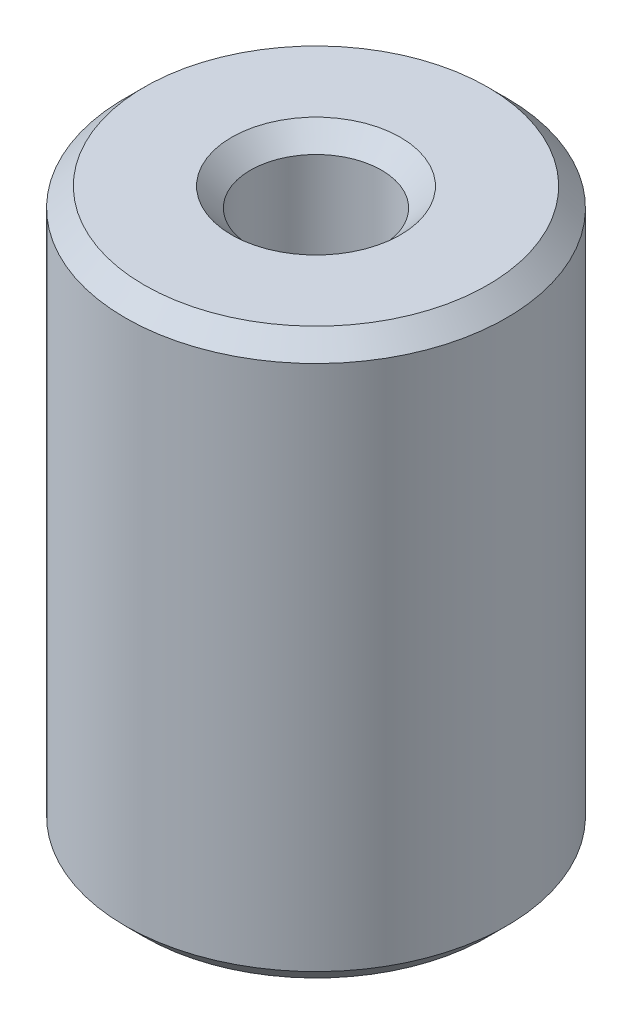
ISO-10303-21;
HEADER;
FILE_DESCRIPTION(('STEP AP214'),'2;1');
FILE_NAME('part.step','',(''),(''),'','','');
FILE_SCHEMA(('AUTOMOTIVE_DESIGN { 1 0 10303 214 1 1 1 1 }'));
ENDSEC;
DATA;
#1=APPLICATION_CONTEXT('core data for automotive mechanical design processes');
#2=APPLICATION_PROTOCOL_DEFINITION('international standard','automotive_design',2000,#1);
#3=PRODUCT_CONTEXT('',#1,'mechanical');
#4=PRODUCT('Part','Part','',(#3));
#5=PRODUCT_RELATED_PRODUCT_CATEGORY('part','',(#4));
#6=PRODUCT_DEFINITION_FORMATION('','',#4);
#7=PRODUCT_DEFINITION_CONTEXT('part definition',#1,'design');
#8=PRODUCT_DEFINITION('design','',#6,#7);
#9=PRODUCT_DEFINITION_SHAPE('','',#8);
#10=(LENGTH_UNIT() NAMED_UNIT(*) SI_UNIT(.MILLI.,.METRE.));
#11=(NAMED_UNIT(*) PLANE_ANGLE_UNIT() SI_UNIT($,.RADIAN.));
#12=(NAMED_UNIT(*) SI_UNIT($,.STERADIAN.) SOLID_ANGLE_UNIT());
#13=UNCERTAINTY_MEASURE_WITH_UNIT(LENGTH_MEASURE(1.E-05),#10,'distance_accuracy_value','');
#14=(GEOMETRIC_REPRESENTATION_CONTEXT(3) GLOBAL_UNCERTAINTY_ASSIGNED_CONTEXT((#13)) GLOBAL_UNIT_ASSIGNED_CONTEXT((#10,
#11,#12)) REPRESENTATION_CONTEXT('',''));
#15=CARTESIAN_POINT('',(0.,0.,0.));
#16=DIRECTION('',(0.,0.,1.));
#17=DIRECTION('',(1.,0.,0.));
#18=AXIS2_PLACEMENT_3D('',#15,#16,#17);
#19=CARTESIAN_POINT('',(0.,22.2178833837886,0.));
#20=DIRECTION('',(0.,-1.,0.));
#21=DIRECTION('',(0.,0.,-1.));
#22=AXIS2_PLACEMENT_3D('',#19,#20,#21);
#23=CYLINDRICAL_SURFACE('',#22,7.5);
#24=CARTESIAN_POINT('',(0.,0.745715691062288,0.));
#25=DIRECTION('',(0.,1.,0.));
#26=DIRECTION('',(0.,0.,1.));
#27=AXIS2_PLACEMENT_3D('',#24,#25,#26);
#28=CIRCLE('',#27,7.5);
#29=CARTESIAN_POINT('',(0.,0.745715691062288,7.5));
#30=VERTEX_POINT('',#29);
#31=EDGE_CURVE('E10',#30,#30,#28,.T.);
#32=ORIENTED_EDGE('',*,*,#31,.T.);
#33=EDGE_LOOP('',(#32));
#34=FACE_BOUND('',#33,.T.);
#35=CARTESIAN_POINT('',(0.,21.4721676927263,0.));
#36=DIRECTION('',(0.,1.,0.));
#37=DIRECTION('',(0.,0.,1.));
#38=AXIS2_PLACEMENT_3D('',#35,#36,#37);
#39=CIRCLE('',#38,7.5);
#40=CARTESIAN_POINT('',(0.,21.4721676927263,7.5));
#41=VERTEX_POINT('',#40);
#42=EDGE_CURVE('E50',#41,#41,#39,.F.);
#43=ORIENTED_EDGE('',*,*,#42,.T.);
#44=EDGE_LOOP('',(#43));
#45=FACE_BOUND('',#44,.T.);
#46=ADVANCED_FACE('F39',(#34,#45),#23,.T.);
#47=CARTESIAN_POINT('',(0.,22.2178833837886,0.));
#48=DIRECTION('',(0.,1.,0.));
#49=DIRECTION('',(0.,0.,1.));
#50=AXIS2_PLACEMENT_3D('',#47,#48,#49);
#51=PLANE('',#50);
#52=CARTESIAN_POINT('',(0.,22.2178833837886,0.));
#53=DIRECTION('',(0.,1.,0.));
#54=DIRECTION('',(0.,0.,1.));
#55=AXIS2_PLACEMENT_3D('',#52,#53,#54);
#56=CIRCLE('',#55,3.32516758982411);
#57=CARTESIAN_POINT('',(0.,22.2178833837886,3.32516758982411));
#58=VERTEX_POINT('',#57);
#59=EDGE_CURVE('E58',#58,#58,#56,.F.);
#60=ORIENTED_EDGE('',*,*,#59,.T.);
#61=EDGE_LOOP('',(#60));
#62=FACE_BOUND('',#61,.T.);
#63=CARTESIAN_POINT('',(0.,22.2178833837886,0.));
#64=DIRECTION('',(0.,1.,0.));
#65=DIRECTION('',(0.,0.,1.));
#66=AXIS2_PLACEMENT_3D('',#63,#64,#65);
#67=CIRCLE('',#66,6.75428430893771);
#68=CARTESIAN_POINT('',(0.,22.2178833837886,6.75428430893771));
#69=VERTEX_POINT('',#68);
#70=EDGE_CURVE('E61',#69,#69,#67,.T.);
#71=ORIENTED_EDGE('',*,*,#70,.T.);
#72=EDGE_LOOP('',(#71));
#73=FACE_BOUND('',#72,.T.);
#74=ADVANCED_FACE('F88',(#62,#73),#51,.T.);
#75=CARTESIAN_POINT('',(0.,0.,0.));
#76=DIRECTION('',(0.,1.,0.));
#77=DIRECTION('',(0.,0.,1.));
#78=AXIS2_PLACEMENT_3D('',#75,#76,#77);
#79=PLANE('',#78);
#80=CARTESIAN_POINT('',(0.,0.,0.));
#81=DIRECTION('',(0.,1.,0.));
#82=DIRECTION('',(0.,0.,1.));
#83=AXIS2_PLACEMENT_3D('',#80,#81,#82);
#84=CIRCLE('',#83,3.3251675898241);
#85=CARTESIAN_POINT('',(0.,0.,-3.3251675898241));
#86=VERTEX_POINT('',#85);
#87=EDGE_CURVE('E51',#86,#86,#84,.T.);
#88=ORIENTED_EDGE('',*,*,#87,.T.);
#89=EDGE_LOOP('',(#88));
#90=FACE_BOUND('',#89,.T.);
#91=CARTESIAN_POINT('',(0.,0.,0.));
#92=DIRECTION('',(0.,1.,0.));
#93=DIRECTION('',(0.,0.,1.));
#94=AXIS2_PLACEMENT_3D('',#91,#92,#93);
#95=CIRCLE('',#94,6.7542843089377);
#96=CARTESIAN_POINT('',(0.,0.,6.7542843089377));
#97=VERTEX_POINT('',#96);
#98=EDGE_CURVE('E54',#97,#97,#95,.F.);
#99=ORIENTED_EDGE('',*,*,#98,.T.);
#100=EDGE_LOOP('',(#99));
#101=FACE_BOUND('',#100,.T.);
#102=ADVANCED_FACE('F83',(#90,#101),#79,.F.);
#103=CARTESIAN_POINT('',(0.,22.2178833837886,0.));
#104=DIRECTION('',(0.,-1.,0.));
#105=DIRECTION('',(0.,0.,-1.));
#106=AXIS2_PLACEMENT_3D('',#103,#104,#105);
#107=CYLINDRICAL_SURFACE('',#106,2.57945189876181);
#108=CARTESIAN_POINT('',(0.,21.4721676927263,0.));
#109=DIRECTION('',(0.,1.,0.));
#110=DIRECTION('',(0.,0.,1.));
#111=AXIS2_PLACEMENT_3D('',#108,#109,#110);
#112=CIRCLE('',#111,2.57945189876181);
#113=CARTESIAN_POINT('',(0.,21.4721676927263,2.57945189876181));
#114=VERTEX_POINT('',#113);
#115=EDGE_CURVE('E67',#114,#114,#112,.T.);
#116=ORIENTED_EDGE('',*,*,#115,.T.);
#117=EDGE_LOOP('',(#116));
#118=FACE_BOUND('',#117,.T.);
#119=CARTESIAN_POINT('',(0.,0.745715691062295,0.));
#120=DIRECTION('',(0.,1.,0.));
#121=DIRECTION('',(0.,0.,1.));
#122=AXIS2_PLACEMENT_3D('',#119,#120,#121);
#123=CIRCLE('',#122,2.57945189876181);
#124=CARTESIAN_POINT('',(0.,0.745715691062295,-2.57945189876181));
#125=VERTEX_POINT('',#124);
#126=EDGE_CURVE('E69',#125,#125,#123,.F.);
#127=ORIENTED_EDGE('',*,*,#126,.T.);
#128=EDGE_LOOP('',(#127));
#129=FACE_BOUND('',#128,.T.);
#130=ADVANCED_FACE('F71',(#118,#129),#107,.F.);
#131=CARTESIAN_POINT('',(0.,21.4721676927263,0.));
#132=DIRECTION('',(0.,1.,0.));
#133=DIRECTION('',(0.,0.,1.));
#134=AXIS2_PLACEMENT_3D('',#131,#132,#133);
#135=CONICAL_SURFACE('',#134,2.57945189876181,0.785398163397454);
#136=ORIENTED_EDGE('',*,*,#59,.F.);
#137=EDGE_LOOP('',(#136));
#138=FACE_BOUND('',#137,.T.);
#139=ORIENTED_EDGE('',*,*,#115,.F.);
#140=EDGE_LOOP('',(#139));
#141=FACE_BOUND('',#140,.T.);
#142=ADVANCED_FACE('F77',(#138,#141),#135,.F.);
#143=CARTESIAN_POINT('',(0.,0.,0.));
#144=DIRECTION('',(0.,-1.,0.));
#145=DIRECTION('',(0.,0.,-1.));
#146=AXIS2_PLACEMENT_3D('',#143,#144,#145);
#147=CONICAL_SURFACE('',#146,3.3251675898241,0.785398163397445);
#148=CARTESIAN_POINT('',(0.,0.745715691062295,-2.57945189876181));
#149=CARTESIAN_POINT('',(0.,0.737947819280396,-2.58721977054371));
#150=CARTESIAN_POINT('',(0.,0.730179947498497,-2.59498764232561));
#151=CARTESIAN_POINT('',(0.,0.714644203934699,-2.61052338588941));
#152=CARTESIAN_POINT('',(0.,0.706876332152801,-2.61829125767131));
#153=CARTESIAN_POINT('',(0.,0.691340588589003,-2.63382700123511));
#154=CARTESIAN_POINT('',(0.,0.683572716807104,-2.641594873017));
#155=CARTESIAN_POINT('',(0.,0.668036973243306,-2.6571306165808));
#156=CARTESIAN_POINT('',(0.,0.660269101461407,-2.6648984883627));
#157=CARTESIAN_POINT('',(0.,0.644733357897609,-2.6804342319265));
#158=CARTESIAN_POINT('',(0.,0.63696548611571,-2.6882021037084));
#159=CARTESIAN_POINT('',(0.,0.621429742551913,-2.7037378472722));
#160=CARTESIAN_POINT('',(0.,0.613661870770014,-2.71150571905409));
#161=CARTESIAN_POINT('',(0.,0.598126127206216,-2.72704146261789));
#162=CARTESIAN_POINT('',(0.,0.590358255424317,-2.73480933439979));
#163=CARTESIAN_POINT('',(0.,0.574822511860519,-2.75034507796359));
#164=CARTESIAN_POINT('',(0.,0.56705464007862,-2.75811294974549));
#165=CARTESIAN_POINT('',(0.,0.551518896514822,-2.77364869330929));
#166=CARTESIAN_POINT('',(0.,0.543751024732923,-2.78141656509118));
#167=CARTESIAN_POINT('',(0.,0.528215281169126,-2.79695230865498));
#168=CARTESIAN_POINT('',(0.,0.520447409387227,-2.80472018043688));
#169=CARTESIAN_POINT('',(0.,0.504911665823429,-2.82025592400068));
#170=CARTESIAN_POINT('',(0.,0.49714379404153,-2.82802379578258));
#171=CARTESIAN_POINT('',(0.,0.481608050477732,-2.84355953934637));
#172=CARTESIAN_POINT('',(0.,0.473840178695833,-2.85132741112827));
#173=CARTESIAN_POINT('',(0.,0.458304435132035,-2.86686315469207));
#174=CARTESIAN_POINT('',(0.,0.450536563350137,-2.87463102647397));
#175=CARTESIAN_POINT('',(0.,0.435000819786339,-2.89016677003777));
#176=CARTESIAN_POINT('',(0.,0.42723294800444,-2.89793464181967));
#177=CARTESIAN_POINT('',(0.,0.411697204440642,-2.91347038538346));
#178=CARTESIAN_POINT('',(0.,0.403929332658743,-2.92123825716536));
#179=CARTESIAN_POINT('',(0.,0.388393589094945,-2.93677400072916));
#180=CARTESIAN_POINT('',(0.,0.380625717313046,-2.94454187251106));
#181=CARTESIAN_POINT('',(0.,0.365089973749249,-2.96007761607486));
#182=CARTESIAN_POINT('',(0.,0.35732210196735,-2.96784548785676));
#183=CARTESIAN_POINT('',(0.,0.341786358403552,-2.98338123142055));
#184=CARTESIAN_POINT('',(0.,0.334018486621653,-2.99114910320245));
#185=CARTESIAN_POINT('',(0.,0.318482743057855,-3.00668484676625));
#186=CARTESIAN_POINT('',(0.,0.310714871275956,-3.01445271854815));
#187=CARTESIAN_POINT('',(0.,0.295179127712158,-3.02998846211195));
#188=CARTESIAN_POINT('',(0.,0.28741125593026,-3.03775633389385));
#189=CARTESIAN_POINT('',(0.,0.271875512366462,-3.05329207745764));
#190=CARTESIAN_POINT('',(0.,0.264107640584563,-3.06105994923954));
#191=CARTESIAN_POINT('',(0.,0.248571897020765,-3.07659569280334));
#192=CARTESIAN_POINT('',(0.,0.240804025238866,-3.08436356458524));
#193=CARTESIAN_POINT('',(0.,0.225268281675068,-3.09989930814904));
#194=CARTESIAN_POINT('',(0.,0.217500409893169,-3.10766717993094));
#195=CARTESIAN_POINT('',(0.,0.201964666329372,-3.12320292349473));
#196=CARTESIAN_POINT('',(0.,0.194196794547473,-3.13097079527663));
#197=CARTESIAN_POINT('',(0.,0.178661050983675,-3.14650653884043));
#198=CARTESIAN_POINT('',(0.,0.170893179201776,-3.15427441062233));
#199=CARTESIAN_POINT('',(0.,0.155357435637978,-3.16981015418613));
#200=CARTESIAN_POINT('',(0.,0.147589563856079,-3.17757802596803));
#201=CARTESIAN_POINT('',(0.,0.132053820292281,-3.19311376953182));
#202=CARTESIAN_POINT('',(0.,0.124285948510382,-3.20088164131372));
#203=CARTESIAN_POINT('',(0.,0.108750204946585,-3.21641738487752));
#204=CARTESIAN_POINT('',(0.,0.100982333164686,-3.22418525665942));
#205=CARTESIAN_POINT('',(0.,0.085446589600888,-3.23972100022322));
#206=CARTESIAN_POINT('',(0.,0.0776787178189891,-3.24748887200511));
#207=CARTESIAN_POINT('',(0.,0.0621429742551912,-3.26302461556891));
#208=CARTESIAN_POINT('',(0.,0.0543751024732923,-3.27079248735081));
#209=CARTESIAN_POINT('',(0.,0.0388393589094945,-3.28632823091461));
#210=CARTESIAN_POINT('',(0.,0.0310714871275956,-3.29409610269651));
#211=CARTESIAN_POINT('',(0.,0.0155357435637979,-3.30963184626031));
#212=CARTESIAN_POINT('',(0.,0.00776787178189902,-3.3173997180422));
#213=CARTESIAN_POINT('',(0.,0.,-3.3251675898241));
#214=B_SPLINE_CURVE_WITH_KNOTS('',3,(#148,#149,#150,#151,#152,#153,#154,#155,#156,#157,#158,
#159,#160,#161,#162,#163,#164,#165,#166,#167,#168,#169,#170,#171,#172,#173,#174,#175,#176,#177,
#178,#179,#180,#181,#182,#183,#184,#185,#186,#187,#188,#189,#190,#191,#192,#193,#194,#195,#196,
#197,#198,#199,#200,#201,#202,#203,#204,#205,#206,#207,#208,#209,#210,#211,#212,#213),
.UNSPECIFIED.,.F.,.F.,(4,2,2,2,2,2,2,2,2,2,2,2,2,2,2,2,2,2,2,2,2,2,2,2,2,2,2,2,2,2,2,2,4),(0.,
0.0329562888742099,0.06591257774842,0.0988688666226299,0.13182515549684,0.16478144437105,
0.19773773324526,0.23069402211947,0.26365031099368,0.29660659986789,0.3295628887421,
0.36251917761631,0.39547546649052,0.428431755364729,0.46138804423894,0.494344333113149,
0.527300621987359,0.560256910861569,0.593213199735779,0.626169488609989,0.659125777484199,
0.692082066358409,0.725038355232619,0.757994644106829,0.790950932981039,0.823907221855249,
0.856863510729459,0.889819799603668,0.922776088477879,0.955732377352088,0.988688666226298,
1.02164495510051,1.05460124397472),.UNSPECIFIED.);
#215=EDGE_CURVE('BSEAM73',#125,#86,#214,.T.);
#216=ORIENTED_EDGE('',*,*,#126,.F.);
#217=ORIENTED_EDGE('',*,*,#87,.F.);
#218=ORIENTED_EDGE('',*,*,#215,.T.);
#219=ORIENTED_EDGE('',*,*,#215,.F.);
#220=EDGE_LOOP('',(#216,#218,#217,#219));
#221=FACE_BOUND('',#220,.T.);
#222=ADVANCED_FACE('F73',(#221),#147,.F.);
#223=CARTESIAN_POINT('',(0.,0.745715691062288,0.));
#224=DIRECTION('',(0.,1.,0.));
#225=DIRECTION('',(0.,0.,1.));
#226=AXIS2_PLACEMENT_3D('',#223,#224,#225);
#227=CONICAL_SURFACE('',#226,7.5,0.785398163397453);
#228=ORIENTED_EDGE('',*,*,#98,.F.);
#229=EDGE_LOOP('',(#228));
#230=FACE_BOUND('',#229,.T.);
#231=ORIENTED_EDGE('',*,*,#31,.F.);
#232=EDGE_LOOP('',(#231));
#233=FACE_BOUND('',#232,.T.);
#234=ADVANCED_FACE('F76',(#230,#233),#227,.T.);
#235=CARTESIAN_POINT('',(0.,22.2178833837886,0.));
#236=DIRECTION('',(0.,-1.,0.));
#237=DIRECTION('',(0.,0.,-1.));
#238=AXIS2_PLACEMENT_3D('',#235,#236,#237);
#239=CONICAL_SURFACE('',#238,6.75428430893771,0.785398163397444);
#240=ORIENTED_EDGE('',*,*,#42,.F.);
#241=EDGE_LOOP('',(#240));
#242=FACE_BOUND('',#241,.T.);
#243=ORIENTED_EDGE('',*,*,#70,.F.);
#244=EDGE_LOOP('',(#243));
#245=FACE_BOUND('',#244,.T.);
#246=ADVANCED_FACE('F45',(#242,#245),#239,.T.);
#247=CLOSED_SHELL('',(#46,#74,#102,#130,#142,#222,#234,#246));
#248=MANIFOLD_SOLID_BREP('B2',#247);
#249=ADVANCED_BREP_SHAPE_REPRESENTATION('',(#18,#248),#14);
#250=SHAPE_DEFINITION_REPRESENTATION(#9,#249);
ENDSEC;
END-ISO-10303-21;
